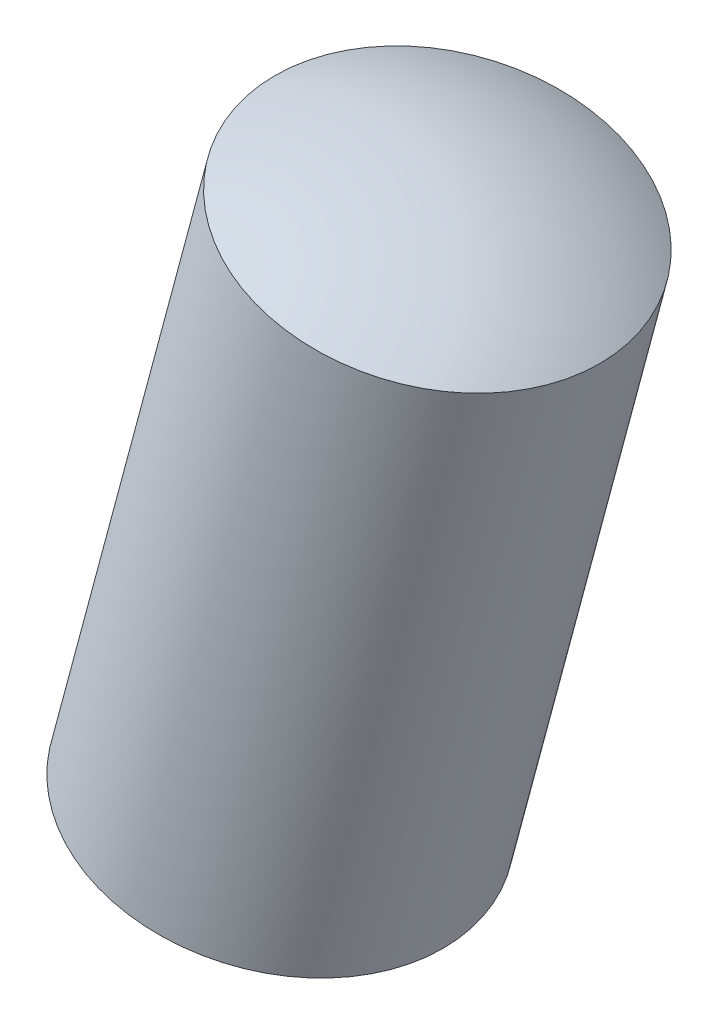
ISO-10303-21;
HEADER;
FILE_DESCRIPTION(('STEP AP214'),'2;1');
FILE_NAME('part.step','',(''),(''),'','','');
FILE_SCHEMA(('AUTOMOTIVE_DESIGN { 1 0 10303 214 1 1 1 1 }'));
ENDSEC;
DATA;
#1=APPLICATION_CONTEXT('core data for automotive mechanical design processes');
#2=APPLICATION_PROTOCOL_DEFINITION('international standard','automotive_design',2000,#1);
#3=PRODUCT_CONTEXT('',#1,'mechanical');
#4=PRODUCT('Part','Part','',(#3));
#5=PRODUCT_RELATED_PRODUCT_CATEGORY('part','',(#4));
#6=PRODUCT_DEFINITION_FORMATION('','',#4);
#7=PRODUCT_DEFINITION_CONTEXT('part definition',#1,'design');
#8=PRODUCT_DEFINITION('design','',#6,#7);
#9=PRODUCT_DEFINITION_SHAPE('','',#8);
#10=(LENGTH_UNIT() NAMED_UNIT(*) SI_UNIT(.MILLI.,.METRE.));
#11=(NAMED_UNIT(*) PLANE_ANGLE_UNIT() SI_UNIT($,.RADIAN.));
#12=(NAMED_UNIT(*) SI_UNIT($,.STERADIAN.) SOLID_ANGLE_UNIT());
#13=UNCERTAINTY_MEASURE_WITH_UNIT(LENGTH_MEASURE(1.E-05),#10,'distance_accuracy_value','');
#14=(GEOMETRIC_REPRESENTATION_CONTEXT(3) GLOBAL_UNCERTAINTY_ASSIGNED_CONTEXT((#13)) GLOBAL_UNIT_ASSIGNED_CONTEXT((#10,
#11,#12)) REPRESENTATION_CONTEXT('',''));
#15=CARTESIAN_POINT('',(0.,0.,0.));
#16=DIRECTION('',(0.,0.,1.));
#17=DIRECTION('',(1.,0.,0.));
#18=AXIS2_PLACEMENT_3D('',#15,#16,#17);
#19=CARTESIAN_POINT('',(7.14390355797009,26.6614110427164,0.9));
#20=DIRECTION('',(0.965925826289068,-0.258819045102521,0.));
#21=DIRECTION('',(0.258819045102522,0.965925826289068,0.));
#22=AXIS2_PLACEMENT_3D('',#19,#20,#21);
#23=SPHERICAL_SURFACE('',#22,3.);
#24=CARTESIAN_POINT('',(7.14390355797009,26.6614110427164,0.9));
#25=DIRECTION('',(-0.258819045102521,-0.965925826289068,0.));
#26=DIRECTION('',(0.,0.,-1.));
#27=AXIS2_PLACEMENT_3D('',#24,#25,#26);
#28=SPHERICAL_SURFACE('',#27,3.);
#29=CARTESIAN_POINT('',(7.81633516209613,29.17095995393,0.9));
#30=DIRECTION('',(-0.258819045102521,-0.965925826289068,0.));
#31=DIRECTION('',(0.,0.,-1.));
#32=AXIS2_PLACEMENT_3D('',#29,#30,#31);
#33=CIRCLE('',#32,1.5);
#34=CARTESIAN_POINT('',(7.81633516209613,29.17095995393,-0.6));
#35=VERTEX_POINT('',#34);
#36=EDGE_CURVE('E11',#35,#35,#33,.T.);
#37=ORIENTED_EDGE('',*,*,#36,.F.);
#38=EDGE_LOOP('',(#37));
#39=FACE_BOUND('',#38,.T.);
#40=ADVANCED_FACE('F17',(#39),#28,.T.);
#41=CARTESIAN_POINT('',(7.09114392266856,26.4645094031823,0.9));
#42=DIRECTION('',(0.965925826289068,-0.258819045102521,0.));
#43=DIRECTION('',(-0.258819045102521,-0.965925826289068,0.));
#44=AXIS2_PLACEMENT_3D('',#41,#42,#43);
#45=SPHERICAL_SURFACE('',#44,3.);
#46=CARTESIAN_POINT('',(7.09114392266856,26.4645094031823,0.9));
#47=DIRECTION('',(-0.258819045102521,-0.965925826289068,0.));
#48=DIRECTION('',(0.,0.,-1.));
#49=AXIS2_PLACEMENT_3D('',#46,#47,#48);
#50=SPHERICAL_SURFACE('',#49,3.);
#51=CARTESIAN_POINT('',(6.41871231854252,23.9549604919689,0.9));
#52=DIRECTION('',(-0.258819045102521,-0.965925826289068,0.));
#53=DIRECTION('',(0.,0.,-1.));
#54=AXIS2_PLACEMENT_3D('',#51,#52,#53);
#55=CIRCLE('',#54,1.5);
#56=CARTESIAN_POINT('',(6.41871231854252,23.9549604919689,-0.6));
#57=VERTEX_POINT('',#56);
#58=EDGE_CURVE('E21',#57,#57,#55,.T.);
#59=ORIENTED_EDGE('',*,*,#58,.T.);
#60=EDGE_LOOP('',(#59));
#61=FACE_BOUND('',#60,.T.);
#62=ADVANCED_FACE('F40',(#61),#50,.T.);
#63=CARTESIAN_POINT('',(6.76811802943093,25.2589603574591,0.9));
#64=DIRECTION('',(-0.258819045102521,-0.965925826289068,0.));
#65=DIRECTION('',(0.,0.,-1.));
#66=AXIS2_PLACEMENT_3D('',#63,#64,#65);
#67=CYLINDRICAL_SURFACE('',#66,1.5);
#68=ORIENTED_EDGE('',*,*,#36,.T.);
#69=EDGE_LOOP('',(#68));
#70=FACE_BOUND('',#69,.T.);
#71=ORIENTED_EDGE('',*,*,#58,.F.);
#72=EDGE_LOOP('',(#71));
#73=FACE_BOUND('',#72,.T.);
#74=ADVANCED_FACE('F19',(#70,#73),#67,.T.);
#75=CLOSED_SHELL('',(#40,#62,#74));
#76=MANIFOLD_SOLID_BREP('B1',#75);
#77=ADVANCED_BREP_SHAPE_REPRESENTATION('',(#18,#76),#14);
#78=SHAPE_DEFINITION_REPRESENTATION(#9,#77);
ENDSEC;
END-ISO-10303-21;
